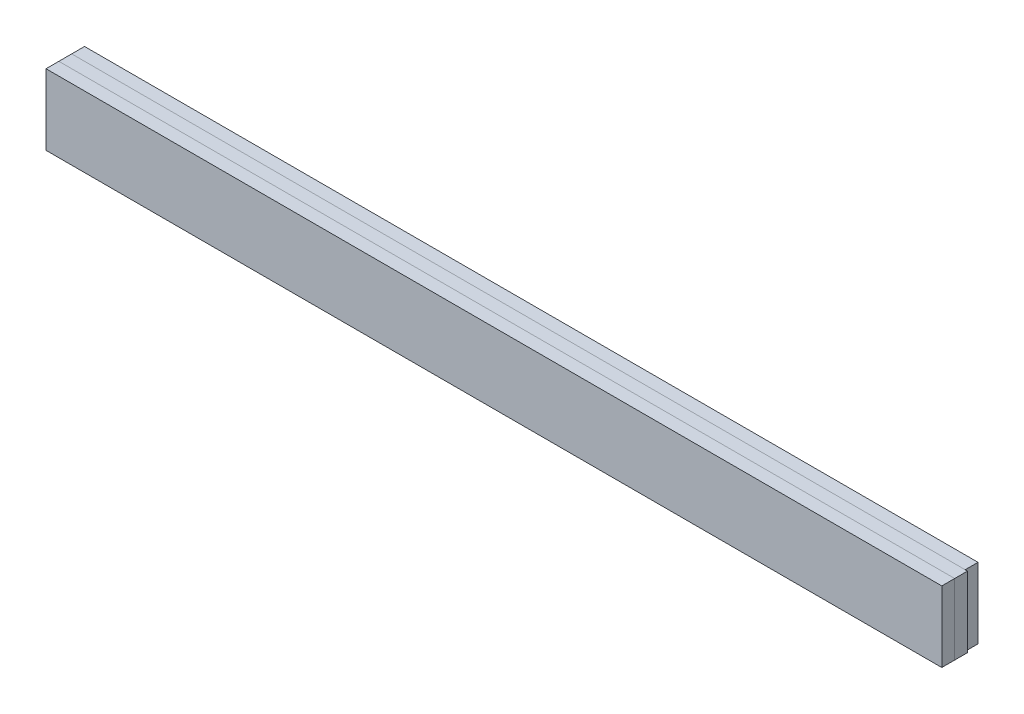
ISO-10303-21;
HEADER;
FILE_DESCRIPTION(('STEP AP214'),'2;1');
FILE_NAME('part.step','',(''),(''),'','','');
FILE_SCHEMA(('AUTOMOTIVE_DESIGN { 1 0 10303 214 1 1 1 1 }'));
ENDSEC;
DATA;
#1=APPLICATION_CONTEXT('core data for automotive mechanical design processes');
#2=APPLICATION_PROTOCOL_DEFINITION('international standard','automotive_design',2000,#1);
#3=PRODUCT_CONTEXT('',#1,'mechanical');
#4=PRODUCT('Part','Part','',(#3));
#5=PRODUCT_RELATED_PRODUCT_CATEGORY('part','',(#4));
#6=PRODUCT_DEFINITION_FORMATION('','',#4);
#7=PRODUCT_DEFINITION_CONTEXT('part definition',#1,'design');
#8=PRODUCT_DEFINITION('design','',#6,#7);
#9=PRODUCT_DEFINITION_SHAPE('','',#8);
#10=(LENGTH_UNIT() NAMED_UNIT(*) SI_UNIT(.MILLI.,.METRE.));
#11=(NAMED_UNIT(*) PLANE_ANGLE_UNIT() SI_UNIT($,.RADIAN.));
#12=(NAMED_UNIT(*) SI_UNIT($,.STERADIAN.) SOLID_ANGLE_UNIT());
#13=UNCERTAINTY_MEASURE_WITH_UNIT(LENGTH_MEASURE(1.E-05),#10,'distance_accuracy_value','');
#14=(GEOMETRIC_REPRESENTATION_CONTEXT(3) GLOBAL_UNCERTAINTY_ASSIGNED_CONTEXT((#13)) GLOBAL_UNIT_ASSIGNED_CONTEXT((#10,
#11,#12)) REPRESENTATION_CONTEXT('',''));
#15=CARTESIAN_POINT('',(0.,0.,0.));
#16=DIRECTION('',(0.,0.,1.));
#17=DIRECTION('',(1.,0.,0.));
#18=AXIS2_PLACEMENT_3D('',#15,#16,#17);
#19=CARTESIAN_POINT('',(34.667480873793,5.5,-1.5));
#20=DIRECTION('',(-1.,0.,0.));
#21=DIRECTION('',(0.,0.,1.));
#22=AXIS2_PLACEMENT_3D('',#19,#20,#21);
#23=PLANE('',#22);
#24=DIRECTION('',(0.,-1.,0.));
#25=VECTOR('',#24,1.);
#26=CARTESIAN_POINT('',(34.667480873793,5.5,-0.5));
#27=LINE('',#26,#25);
#28=CARTESIAN_POINT('',(34.667480873793,5.5,-0.5));
#29=VERTEX_POINT('',#28);
#30=CARTESIAN_POINT('',(34.667480873793,0.,-0.5));
#31=VERTEX_POINT('',#30);
#32=EDGE_CURVE('E108',#29,#31,#27,.T.);
#33=ORIENTED_EDGE('',*,*,#32,.T.);
#34=DIRECTION('',(0.,0.,1.));
#35=VECTOR('',#34,1.);
#36=CARTESIAN_POINT('',(34.667480873793,0.,-1.5));
#37=LINE('',#36,#35);
#38=CARTESIAN_POINT('',(34.667480873793,0.,-1.5));
#39=VERTEX_POINT('',#38);
#40=EDGE_CURVE('E12',#39,#31,#37,.T.);
#41=ORIENTED_EDGE('',*,*,#40,.F.);
#42=DIRECTION('',(0.,-1.,0.));
#43=VECTOR('',#42,1.);
#44=CARTESIAN_POINT('',(34.667480873793,5.5,-1.5));
#45=LINE('',#44,#43);
#46=CARTESIAN_POINT('',(34.667480873793,5.5,-1.5));
#47=VERTEX_POINT('',#46);
#48=EDGE_CURVE('E96',#47,#39,#45,.T.);
#49=ORIENTED_EDGE('',*,*,#48,.F.);
#50=DIRECTION('',(0.,0.,1.));
#51=VECTOR('',#50,1.);
#52=CARTESIAN_POINT('',(34.667480873793,5.5,-1.5));
#53=LINE('',#52,#51);
#54=EDGE_CURVE('E104',#47,#29,#53,.T.);
#55=ORIENTED_EDGE('',*,*,#54,.T.);
#56=EDGE_LOOP('',(#33,#41,#49,#55));
#57=FACE_BOUND('',#56,.T.);
#58=ADVANCED_FACE('F45',(#57),#23,.F.);
#59=CARTESIAN_POINT('',(34.667480873793,0.,-1.5));
#60=DIRECTION('',(0.,1.,0.));
#61=DIRECTION('',(0.,0.,1.));
#62=AXIS2_PLACEMENT_3D('',#59,#60,#61);
#63=PLANE('',#62);
#64=DIRECTION('',(-1.,0.,0.));
#65=VECTOR('',#64,1.);
#66=CARTESIAN_POINT('',(34.667480873793,0.,-0.5));
#67=LINE('',#66,#65);
#68=CARTESIAN_POINT('',(-34.85,0.,-0.5));
#69=VERTEX_POINT('',#68);
#70=EDGE_CURVE('E100',#31,#69,#67,.T.);
#71=ORIENTED_EDGE('',*,*,#70,.T.);
#72=DIRECTION('',(0.,0.,1.));
#73=VECTOR('',#72,1.);
#74=CARTESIAN_POINT('',(-34.85,0.,-1.5));
#75=LINE('',#74,#73);
#76=CARTESIAN_POINT('',(-34.85,0.,-1.5));
#77=VERTEX_POINT('',#76);
#78=EDGE_CURVE('E53',#77,#69,#75,.T.);
#79=ORIENTED_EDGE('',*,*,#78,.F.);
#80=DIRECTION('',(-1.,0.,0.));
#81=VECTOR('',#80,1.);
#82=CARTESIAN_POINT('',(34.667480873793,0.,-1.5));
#83=LINE('',#82,#81);
#84=EDGE_CURVE('E91',#39,#77,#83,.T.);
#85=ORIENTED_EDGE('',*,*,#84,.F.);
#86=ORIENTED_EDGE('',*,*,#40,.T.);
#87=EDGE_LOOP('',(#71,#79,#85,#86));
#88=FACE_BOUND('',#87,.T.);
#89=ADVANCED_FACE('F99',(#88),#63,.F.);
#90=CARTESIAN_POINT('',(-34.85,5.5,-1.5));
#91=DIRECTION('',(1.,0.,0.));
#92=DIRECTION('',(0.,0.,-1.));
#93=AXIS2_PLACEMENT_3D('',#90,#91,#92);
#94=PLANE('',#93);
#95=DIRECTION('',(0.,1.,0.));
#96=VECTOR('',#95,1.);
#97=CARTESIAN_POINT('',(-34.85,5.5,-0.5));
#98=LINE('',#97,#96);
#99=CARTESIAN_POINT('',(-34.85,5.5,-0.5));
#100=VERTEX_POINT('',#99);
#101=EDGE_CURVE('E78',#69,#100,#98,.T.);
#102=ORIENTED_EDGE('',*,*,#101,.T.);
#103=DIRECTION('',(0.,0.,1.));
#104=VECTOR('',#103,1.);
#105=CARTESIAN_POINT('',(-34.85,5.5,-1.5));
#106=LINE('',#105,#104);
#107=CARTESIAN_POINT('',(-34.85,5.5,-1.5));
#108=VERTEX_POINT('',#107);
#109=EDGE_CURVE('E101',#108,#100,#106,.T.);
#110=ORIENTED_EDGE('',*,*,#109,.F.);
#111=DIRECTION('',(0.,1.,0.));
#112=VECTOR('',#111,1.);
#113=CARTESIAN_POINT('',(-34.85,5.5,-1.5));
#114=LINE('',#113,#112);
#115=EDGE_CURVE('E94',#77,#108,#114,.T.);
#116=ORIENTED_EDGE('',*,*,#115,.F.);
#117=ORIENTED_EDGE('',*,*,#78,.T.);
#118=EDGE_LOOP('',(#102,#110,#116,#117));
#119=FACE_BOUND('',#118,.T.);
#120=ADVANCED_FACE('F102',(#119),#94,.F.);
#121=CARTESIAN_POINT('',(34.667480873793,5.5,-1.5));
#122=DIRECTION('',(0.,-1.,0.));
#123=DIRECTION('',(0.,0.,-1.));
#124=AXIS2_PLACEMENT_3D('',#121,#122,#123);
#125=PLANE('',#124);
#126=DIRECTION('',(1.,0.,0.));
#127=VECTOR('',#126,1.);
#128=CARTESIAN_POINT('',(34.667480873793,5.5,-0.5));
#129=LINE('',#128,#127);
#130=EDGE_CURVE('E84',#100,#29,#129,.T.);
#131=ORIENTED_EDGE('',*,*,#130,.T.);
#132=ORIENTED_EDGE('',*,*,#54,.F.);
#133=DIRECTION('',(1.,0.,0.));
#134=VECTOR('',#133,1.);
#135=CARTESIAN_POINT('',(34.667480873793,5.5,-1.5));
#136=LINE('',#135,#134);
#137=EDGE_CURVE('E61',#108,#47,#136,.T.);
#138=ORIENTED_EDGE('',*,*,#137,.F.);
#139=ORIENTED_EDGE('',*,*,#109,.T.);
#140=EDGE_LOOP('',(#131,#132,#138,#139));
#141=FACE_BOUND('',#140,.T.);
#142=ADVANCED_FACE('F115',(#141),#125,.F.);
#143=CARTESIAN_POINT('',(0.,0.,-1.5));
#144=DIRECTION('',(0.,0.,-1.));
#145=DIRECTION('',(-1.,0.,0.));
#146=AXIS2_PLACEMENT_3D('',#143,#144,#145);
#147=PLANE('',#146);
#148=ORIENTED_EDGE('',*,*,#48,.T.);
#149=ORIENTED_EDGE('',*,*,#84,.T.);
#150=ORIENTED_EDGE('',*,*,#115,.T.);
#151=ORIENTED_EDGE('',*,*,#137,.T.);
#152=EDGE_LOOP('',(#148,#149,#150,#151));
#153=FACE_BOUND('',#152,.T.);
#154=ADVANCED_FACE('F92',(#153),#147,.T.);
#155=CARTESIAN_POINT('',(0.,0.,-0.5));
#156=DIRECTION('',(0.,0.,-1.));
#157=DIRECTION('',(-1.,0.,0.));
#158=AXIS2_PLACEMENT_3D('',#155,#156,#157);
#159=PLANE('',#158);
#160=ORIENTED_EDGE('',*,*,#32,.F.);
#161=ORIENTED_EDGE('',*,*,#130,.F.);
#162=ORIENTED_EDGE('',*,*,#101,.F.);
#163=ORIENTED_EDGE('',*,*,#70,.F.);
#164=EDGE_LOOP('',(#160,#161,#162,#163));
#165=FACE_BOUND('',#164,.T.);
#166=ADVANCED_FACE('F118',(#165),#159,.F.);
#167=CLOSED_SHELL('',(#58,#89,#120,#142,#154,#166));
#168=MANIFOLD_SOLID_BREP('B2',#167);
#169=CARTESIAN_POINT('',(-34.85,5.5,1.5));
#170=DIRECTION('',(1.,0.,0.));
#171=DIRECTION('',(0.,0.,-1.));
#172=AXIS2_PLACEMENT_3D('',#169,#170,#171);
#173=PLANE('',#172);
#174=DIRECTION('',(0.,-1.,0.));
#175=VECTOR('',#174,1.);
#176=CARTESIAN_POINT('',(-34.85,5.5,0.5));
#177=LINE('',#176,#175);
#178=CARTESIAN_POINT('',(-34.85,5.5,0.5));
#179=VERTEX_POINT('',#178);
#180=CARTESIAN_POINT('',(-34.85,0.,0.5));
#181=VERTEX_POINT('',#180);
#182=EDGE_CURVE('E240',#179,#181,#177,.T.);
#183=ORIENTED_EDGE('',*,*,#182,.T.);
#184=DIRECTION('',(0.,0.,-1.));
#185=VECTOR('',#184,1.);
#186=CARTESIAN_POINT('',(-34.85,0.,1.5));
#187=LINE('',#186,#185);
#188=CARTESIAN_POINT('',(-34.85,0.,1.5));
#189=VERTEX_POINT('',#188);
#190=EDGE_CURVE('E43',#189,#181,#187,.T.);
#191=ORIENTED_EDGE('',*,*,#190,.F.);
#192=DIRECTION('',(0.,-1.,0.));
#193=VECTOR('',#192,1.);
#194=CARTESIAN_POINT('',(-34.85,5.5,1.5));
#195=LINE('',#194,#193);
#196=CARTESIAN_POINT('',(-34.85,5.5,1.5));
#197=VERTEX_POINT('',#196);
#198=EDGE_CURVE('E228',#197,#189,#195,.T.);
#199=ORIENTED_EDGE('',*,*,#198,.F.);
#200=DIRECTION('',(0.,0.,-1.));
#201=VECTOR('',#200,1.);
#202=CARTESIAN_POINT('',(-34.85,5.5,1.5));
#203=LINE('',#202,#201);
#204=EDGE_CURVE('E236',#197,#179,#203,.T.);
#205=ORIENTED_EDGE('',*,*,#204,.T.);
#206=EDGE_LOOP('',(#183,#191,#199,#205));
#207=FACE_BOUND('',#206,.T.);
#208=ADVANCED_FACE('F177',(#207),#173,.F.);
#209=CARTESIAN_POINT('',(-34.85,0.,1.5));
#210=DIRECTION('',(0.,1.,0.));
#211=DIRECTION('',(0.,0.,1.));
#212=AXIS2_PLACEMENT_3D('',#209,#210,#211);
#213=PLANE('',#212);
#214=DIRECTION('',(1.,0.,0.));
#215=VECTOR('',#214,1.);
#216=CARTESIAN_POINT('',(-34.85,0.,0.5));
#217=LINE('',#216,#215);
#218=CARTESIAN_POINT('',(34.85,0.,0.5));
#219=VERTEX_POINT('',#218);
#220=EDGE_CURVE('E232',#181,#219,#217,.T.);
#221=ORIENTED_EDGE('',*,*,#220,.T.);
#222=DIRECTION('',(0.,0.,-1.));
#223=VECTOR('',#222,1.);
#224=CARTESIAN_POINT('',(34.85,0.,1.5));
#225=LINE('',#224,#223);
#226=CARTESIAN_POINT('',(34.85,0.,1.5));
#227=VERTEX_POINT('',#226);
#228=EDGE_CURVE('E185',#227,#219,#225,.T.);
#229=ORIENTED_EDGE('',*,*,#228,.F.);
#230=DIRECTION('',(1.,0.,0.));
#231=VECTOR('',#230,1.);
#232=CARTESIAN_POINT('',(-34.85,0.,1.5));
#233=LINE('',#232,#231);
#234=EDGE_CURVE('E223',#189,#227,#233,.T.);
#235=ORIENTED_EDGE('',*,*,#234,.F.);
#236=ORIENTED_EDGE('',*,*,#190,.T.);
#237=EDGE_LOOP('',(#221,#229,#235,#236));
#238=FACE_BOUND('',#237,.T.);
#239=ADVANCED_FACE('F231',(#238),#213,.F.);
#240=CARTESIAN_POINT('',(34.85,5.5,1.5));
#241=DIRECTION('',(-1.,0.,0.));
#242=DIRECTION('',(0.,0.,1.));
#243=AXIS2_PLACEMENT_3D('',#240,#241,#242);
#244=PLANE('',#243);
#245=DIRECTION('',(0.,1.,0.));
#246=VECTOR('',#245,1.);
#247=CARTESIAN_POINT('',(34.85,5.5,0.5));
#248=LINE('',#247,#246);
#249=CARTESIAN_POINT('',(34.85,5.5,0.5));
#250=VERTEX_POINT('',#249);
#251=EDGE_CURVE('E210',#219,#250,#248,.T.);
#252=ORIENTED_EDGE('',*,*,#251,.T.);
#253=DIRECTION('',(0.,0.,-1.));
#254=VECTOR('',#253,1.);
#255=CARTESIAN_POINT('',(34.85,5.5,1.5));
#256=LINE('',#255,#254);
#257=CARTESIAN_POINT('',(34.85,5.5,1.5));
#258=VERTEX_POINT('',#257);
#259=EDGE_CURVE('E233',#258,#250,#256,.T.);
#260=ORIENTED_EDGE('',*,*,#259,.F.);
#261=DIRECTION('',(0.,1.,0.));
#262=VECTOR('',#261,1.);
#263=CARTESIAN_POINT('',(34.85,5.5,1.5));
#264=LINE('',#263,#262);
#265=EDGE_CURVE('E226',#227,#258,#264,.T.);
#266=ORIENTED_EDGE('',*,*,#265,.F.);
#267=ORIENTED_EDGE('',*,*,#228,.T.);
#268=EDGE_LOOP('',(#252,#260,#266,#267));
#269=FACE_BOUND('',#268,.T.);
#270=ADVANCED_FACE('F234',(#269),#244,.F.);
#271=CARTESIAN_POINT('',(-34.85,5.5,1.5));
#272=DIRECTION('',(0.,-1.,0.));
#273=DIRECTION('',(0.,0.,-1.));
#274=AXIS2_PLACEMENT_3D('',#271,#272,#273);
#275=PLANE('',#274);
#276=DIRECTION('',(-1.,0.,0.));
#277=VECTOR('',#276,1.);
#278=CARTESIAN_POINT('',(-34.85,5.5,0.5));
#279=LINE('',#278,#277);
#280=EDGE_CURVE('E216',#250,#179,#279,.T.);
#281=ORIENTED_EDGE('',*,*,#280,.T.);
#282=ORIENTED_EDGE('',*,*,#204,.F.);
#283=DIRECTION('',(-1.,0.,0.));
#284=VECTOR('',#283,1.);
#285=CARTESIAN_POINT('',(-34.85,5.5,1.5));
#286=LINE('',#285,#284);
#287=EDGE_CURVE('E193',#258,#197,#286,.T.);
#288=ORIENTED_EDGE('',*,*,#287,.F.);
#289=ORIENTED_EDGE('',*,*,#259,.T.);
#290=EDGE_LOOP('',(#281,#282,#288,#289));
#291=FACE_BOUND('',#290,.T.);
#292=ADVANCED_FACE('F247',(#291),#275,.F.);
#293=CARTESIAN_POINT('',(0.,0.,1.5));
#294=DIRECTION('',(0.,0.,1.));
#295=DIRECTION('',(1.,0.,0.));
#296=AXIS2_PLACEMENT_3D('',#293,#294,#295);
#297=PLANE('',#296);
#298=ORIENTED_EDGE('',*,*,#198,.T.);
#299=ORIENTED_EDGE('',*,*,#234,.T.);
#300=ORIENTED_EDGE('',*,*,#265,.T.);
#301=ORIENTED_EDGE('',*,*,#287,.T.);
#302=EDGE_LOOP('',(#298,#299,#300,#301));
#303=FACE_BOUND('',#302,.T.);
#304=ADVANCED_FACE('F224',(#303),#297,.T.);
#305=CARTESIAN_POINT('',(0.,0.,0.5));
#306=DIRECTION('',(0.,0.,1.));
#307=DIRECTION('',(1.,0.,0.));
#308=AXIS2_PLACEMENT_3D('',#305,#306,#307);
#309=PLANE('',#308);
#310=ORIENTED_EDGE('',*,*,#182,.F.);
#311=ORIENTED_EDGE('',*,*,#280,.F.);
#312=ORIENTED_EDGE('',*,*,#251,.F.);
#313=ORIENTED_EDGE('',*,*,#220,.F.);
#314=EDGE_LOOP('',(#310,#311,#312,#313));
#315=FACE_BOUND('',#314,.T.);
#316=ADVANCED_FACE('F250',(#315),#309,.F.);
#317=CLOSED_SHELL('',(#208,#239,#270,#292,#304,#316));
#318=MANIFOLD_SOLID_BREP('B6',#317);
#319=CARTESIAN_POINT('',(-34.85,5.5,0.5));
#320=DIRECTION('',(1.,0.,0.));
#321=DIRECTION('',(0.,0.,-1.));
#322=AXIS2_PLACEMENT_3D('',#319,#320,#321);
#323=PLANE('',#322);
#324=DIRECTION('',(0.,-1.,0.));
#325=VECTOR('',#324,1.);
#326=CARTESIAN_POINT('',(-34.85,5.5,-0.5));
#327=LINE('',#326,#325);
#328=CARTESIAN_POINT('',(-34.85,5.5,-0.5));
#329=VERTEX_POINT('',#328);
#330=CARTESIAN_POINT('',(-34.85,0.,-0.5));
#331=VERTEX_POINT('',#330);
#332=EDGE_CURVE('E363',#329,#331,#327,.T.);
#333=ORIENTED_EDGE('',*,*,#332,.T.);
#334=DIRECTION('',(0.,0.,-1.));
#335=VECTOR('',#334,1.);
#336=CARTESIAN_POINT('',(-34.85,0.,0.5));
#337=LINE('',#336,#335);
#338=CARTESIAN_POINT('',(-34.85,0.,0.5));
#339=VERTEX_POINT('',#338);
#340=EDGE_CURVE('E175',#339,#331,#337,.T.);
#341=ORIENTED_EDGE('',*,*,#340,.F.);
#342=DIRECTION('',(0.,-1.,0.));
#343=VECTOR('',#342,1.);
#344=CARTESIAN_POINT('',(-34.85,5.5,0.5));
#345=LINE('',#344,#343);
#346=CARTESIAN_POINT('',(-34.85,5.5,0.5));
#347=VERTEX_POINT('',#346);
#348=EDGE_CURVE('E351',#347,#339,#345,.T.);
#349=ORIENTED_EDGE('',*,*,#348,.F.);
#350=DIRECTION('',(0.,0.,-1.));
#351=VECTOR('',#350,1.);
#352=CARTESIAN_POINT('',(-34.85,5.5,0.5));
#353=LINE('',#352,#351);
#354=EDGE_CURVE('E359',#347,#329,#353,.T.);
#355=ORIENTED_EDGE('',*,*,#354,.T.);
#356=EDGE_LOOP('',(#333,#341,#349,#355));
#357=FACE_BOUND('',#356,.T.);
#358=ADVANCED_FACE('F300',(#357),#323,.F.);
#359=CARTESIAN_POINT('',(-34.85,0.,0.5));
#360=DIRECTION('',(0.,1.,0.));
#361=DIRECTION('',(0.,0.,1.));
#362=AXIS2_PLACEMENT_3D('',#359,#360,#361);
#363=PLANE('',#362);
#364=DIRECTION('',(1.,0.,0.));
#365=VECTOR('',#364,1.);
#366=CARTESIAN_POINT('',(-34.85,0.,-0.5));
#367=LINE('',#366,#365);
#368=CARTESIAN_POINT('',(34.85,0.,-0.5));
#369=VERTEX_POINT('',#368);
#370=EDGE_CURVE('E355',#331,#369,#367,.T.);
#371=ORIENTED_EDGE('',*,*,#370,.T.);
#372=DIRECTION('',(0.,0.,-1.));
#373=VECTOR('',#372,1.);
#374=CARTESIAN_POINT('',(34.85,0.,0.5));
#375=LINE('',#374,#373);
#376=CARTESIAN_POINT('',(34.85,0.,0.5));
#377=VERTEX_POINT('',#376);
#378=EDGE_CURVE('E308',#377,#369,#375,.T.);
#379=ORIENTED_EDGE('',*,*,#378,.F.);
#380=DIRECTION('',(1.,0.,0.));
#381=VECTOR('',#380,1.);
#382=CARTESIAN_POINT('',(-34.85,0.,0.5));
#383=LINE('',#382,#381);
#384=EDGE_CURVE('E346',#339,#377,#383,.T.);
#385=ORIENTED_EDGE('',*,*,#384,.F.);
#386=ORIENTED_EDGE('',*,*,#340,.T.);
#387=EDGE_LOOP('',(#371,#379,#385,#386));
#388=FACE_BOUND('',#387,.T.);
#389=ADVANCED_FACE('F354',(#388),#363,.F.);
#390=CARTESIAN_POINT('',(34.85,5.5,0.5));
#391=DIRECTION('',(-1.,0.,0.));
#392=DIRECTION('',(0.,0.,1.));
#393=AXIS2_PLACEMENT_3D('',#390,#391,#392);
#394=PLANE('',#393);
#395=DIRECTION('',(0.,1.,0.));
#396=VECTOR('',#395,1.);
#397=CARTESIAN_POINT('',(34.85,5.5,-0.5));
#398=LINE('',#397,#396);
#399=CARTESIAN_POINT('',(34.85,5.5,-0.5));
#400=VERTEX_POINT('',#399);
#401=EDGE_CURVE('E333',#369,#400,#398,.T.);
#402=ORIENTED_EDGE('',*,*,#401,.T.);
#403=DIRECTION('',(0.,0.,-1.));
#404=VECTOR('',#403,1.);
#405=CARTESIAN_POINT('',(34.85,5.5,0.5));
#406=LINE('',#405,#404);
#407=CARTESIAN_POINT('',(34.85,5.5,0.5));
#408=VERTEX_POINT('',#407);
#409=EDGE_CURVE('E356',#408,#400,#406,.T.);
#410=ORIENTED_EDGE('',*,*,#409,.F.);
#411=DIRECTION('',(0.,1.,0.));
#412=VECTOR('',#411,1.);
#413=CARTESIAN_POINT('',(34.85,5.5,0.5));
#414=LINE('',#413,#412);
#415=EDGE_CURVE('E349',#377,#408,#414,.T.);
#416=ORIENTED_EDGE('',*,*,#415,.F.);
#417=ORIENTED_EDGE('',*,*,#378,.T.);
#418=EDGE_LOOP('',(#402,#410,#416,#417));
#419=FACE_BOUND('',#418,.T.);
#420=ADVANCED_FACE('F357',(#419),#394,.F.);
#421=CARTESIAN_POINT('',(-34.85,5.5,0.5));
#422=DIRECTION('',(0.,-1.,0.));
#423=DIRECTION('',(0.,0.,-1.));
#424=AXIS2_PLACEMENT_3D('',#421,#422,#423);
#425=PLANE('',#424);
#426=DIRECTION('',(-1.,0.,0.));
#427=VECTOR('',#426,1.);
#428=CARTESIAN_POINT('',(-34.85,5.5,-0.5));
#429=LINE('',#428,#427);
#430=EDGE_CURVE('E339',#400,#329,#429,.T.);
#431=ORIENTED_EDGE('',*,*,#430,.T.);
#432=ORIENTED_EDGE('',*,*,#354,.F.);
#433=DIRECTION('',(-1.,0.,0.));
#434=VECTOR('',#433,1.);
#435=CARTESIAN_POINT('',(-34.85,5.5,0.5));
#436=LINE('',#435,#434);
#437=EDGE_CURVE('E316',#408,#347,#436,.T.);
#438=ORIENTED_EDGE('',*,*,#437,.F.);
#439=ORIENTED_EDGE('',*,*,#409,.T.);
#440=EDGE_LOOP('',(#431,#432,#438,#439));
#441=FACE_BOUND('',#440,.T.);
#442=ADVANCED_FACE('F370',(#441),#425,.F.);
#443=CARTESIAN_POINT('',(0.,0.,0.5));
#444=DIRECTION('',(0.,0.,1.));
#445=DIRECTION('',(1.,0.,0.));
#446=AXIS2_PLACEMENT_3D('',#443,#444,#445);
#447=PLANE('',#446);
#448=ORIENTED_EDGE('',*,*,#348,.T.);
#449=ORIENTED_EDGE('',*,*,#384,.T.);
#450=ORIENTED_EDGE('',*,*,#415,.T.);
#451=ORIENTED_EDGE('',*,*,#437,.T.);
#452=EDGE_LOOP('',(#448,#449,#450,#451));
#453=FACE_BOUND('',#452,.T.);
#454=ADVANCED_FACE('F347',(#453),#447,.T.);
#455=CARTESIAN_POINT('',(0.,0.,-0.5));
#456=DIRECTION('',(0.,0.,1.));
#457=DIRECTION('',(1.,0.,0.));
#458=AXIS2_PLACEMENT_3D('',#455,#456,#457);
#459=PLANE('',#458);
#460=ORIENTED_EDGE('',*,*,#332,.F.);
#461=ORIENTED_EDGE('',*,*,#430,.F.);
#462=ORIENTED_EDGE('',*,*,#401,.F.);
#463=ORIENTED_EDGE('',*,*,#370,.F.);
#464=EDGE_LOOP('',(#460,#461,#462,#463));
#465=FACE_BOUND('',#464,.T.);
#466=ADVANCED_FACE('F373',(#465),#459,.F.);
#467=CLOSED_SHELL('',(#358,#389,#420,#442,#454,#466));
#468=MANIFOLD_SOLID_BREP('B37',#467);
#469=ADVANCED_BREP_SHAPE_REPRESENTATION('',(#18,#168,#318,#468),#14);
#470=SHAPE_DEFINITION_REPRESENTATION(#9,#469);
ENDSEC;
END-ISO-10303-21;
